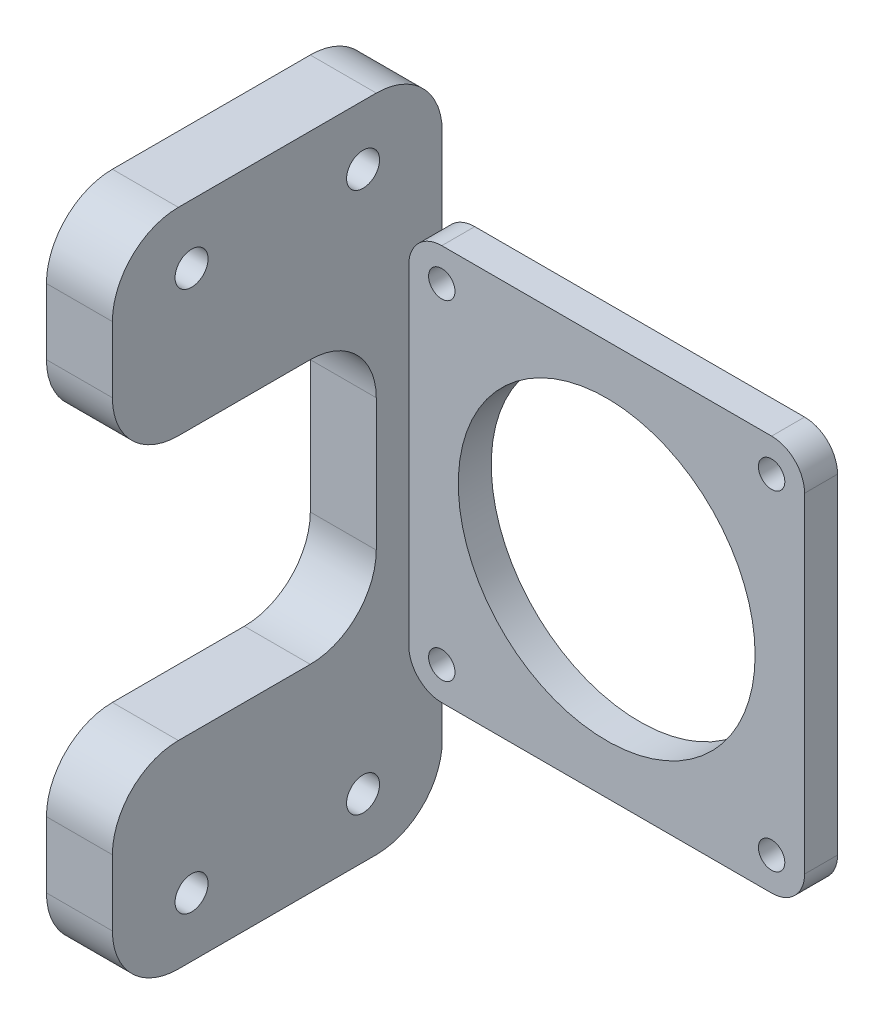
ISO-10303-21;
HEADER;
FILE_DESCRIPTION(('STEP AP214'),'2;1');
FILE_NAME('part.step','',(''),(''),'','','');
FILE_SCHEMA(('AUTOMOTIVE_DESIGN { 1 0 10303 214 1 1 1 1 }'));
ENDSEC;
DATA;
#1=APPLICATION_CONTEXT('core data for automotive mechanical design processes');
#2=APPLICATION_PROTOCOL_DEFINITION('international standard','automotive_design',2000,#1);
#3=PRODUCT_CONTEXT('',#1,'mechanical');
#4=PRODUCT('Part','Part','',(#3));
#5=PRODUCT_RELATED_PRODUCT_CATEGORY('part','',(#4));
#6=PRODUCT_DEFINITION_FORMATION('','',#4);
#7=PRODUCT_DEFINITION_CONTEXT('part definition',#1,'design');
#8=PRODUCT_DEFINITION('design','',#6,#7);
#9=PRODUCT_DEFINITION_SHAPE('','',#8);
#10=(LENGTH_UNIT() NAMED_UNIT(*) SI_UNIT(.MILLI.,.METRE.));
#11=(NAMED_UNIT(*) PLANE_ANGLE_UNIT() SI_UNIT($,.RADIAN.));
#12=(NAMED_UNIT(*) SI_UNIT($,.STERADIAN.) SOLID_ANGLE_UNIT());
#13=UNCERTAINTY_MEASURE_WITH_UNIT(LENGTH_MEASURE(1.E-05),#10,'distance_accuracy_value','');
#14=(GEOMETRIC_REPRESENTATION_CONTEXT(3) GLOBAL_UNCERTAINTY_ASSIGNED_CONTEXT((#13)) GLOBAL_UNIT_ASSIGNED_CONTEXT((#10,
#11,#12)) REPRESENTATION_CONTEXT('',''));
#15=CARTESIAN_POINT('',(0.,0.,0.));
#16=DIRECTION('',(0.,0.,1.));
#17=DIRECTION('',(1.,0.,0.));
#18=AXIS2_PLACEMENT_3D('',#15,#16,#17);
#19=CARTESIAN_POINT('',(-25.,-25.,5.));
#20=DIRECTION('',(0.,0.,-1.));
#21=DIRECTION('',(-1.,0.,0.));
#22=AXIS2_PLACEMENT_3D('',#19,#20,#21);
#23=PLANE('',#22);
#24=CARTESIAN_POINT('',(-25.,-25.,5.));
#25=DIRECTION('',(0.,0.,1.));
#26=DIRECTION('',(-1.,0.,0.));
#27=AXIS2_PLACEMENT_3D('',#24,#25,#26);
#28=CIRCLE('',#27,5.);
#29=CARTESIAN_POINT('',(-30.,-25.,5.));
#30=VERTEX_POINT('',#29);
#31=CARTESIAN_POINT('',(-25.,-30.,5.));
#32=VERTEX_POINT('',#31);
#33=EDGE_CURVE('E148',#30,#32,#28,.T.);
#34=ORIENTED_EDGE('',*,*,#33,.T.);
#35=DIRECTION('',(1.,0.,0.));
#36=VECTOR('',#35,1.);
#37=CARTESIAN_POINT('',(25.,-30.,5.));
#38=LINE('',#37,#36);
#39=CARTESIAN_POINT('',(25.,-30.,5.));
#40=VERTEX_POINT('',#39);
#41=EDGE_CURVE('E93',#32,#40,#38,.T.);
#42=ORIENTED_EDGE('',*,*,#41,.T.);
#43=CARTESIAN_POINT('',(25.,-25.,5.));
#44=DIRECTION('',(0.,0.,1.));
#45=DIRECTION('',(-1.,0.,0.));
#46=AXIS2_PLACEMENT_3D('',#43,#44,#45);
#47=CIRCLE('',#46,5.);
#48=CARTESIAN_POINT('',(30.,-24.9999999999999,5.));
#49=VERTEX_POINT('',#48);
#50=EDGE_CURVE('E163',#40,#49,#47,.T.);
#51=ORIENTED_EDGE('',*,*,#50,.T.);
#52=DIRECTION('',(0.,1.,0.));
#53=VECTOR('',#52,1.);
#54=CARTESIAN_POINT('',(30.,25.,5.));
#55=LINE('',#54,#53);
#56=CARTESIAN_POINT('',(30.,25.,5.));
#57=VERTEX_POINT('',#56);
#58=EDGE_CURVE('E175',#49,#57,#55,.T.);
#59=ORIENTED_EDGE('',*,*,#58,.T.);
#60=CARTESIAN_POINT('',(25.,25.,5.));
#61=DIRECTION('',(0.,0.,1.));
#62=DIRECTION('',(1.,0.,0.));
#63=AXIS2_PLACEMENT_3D('',#60,#61,#62);
#64=CIRCLE('',#63,5.);
#65=CARTESIAN_POINT('',(25.,30.,5.));
#66=VERTEX_POINT('',#65);
#67=EDGE_CURVE('E114',#57,#66,#64,.T.);
#68=ORIENTED_EDGE('',*,*,#67,.T.);
#69=DIRECTION('',(-1.,0.,0.));
#70=VECTOR('',#69,1.);
#71=CARTESIAN_POINT('',(25.,30.,5.));
#72=LINE('',#71,#70);
#73=CARTESIAN_POINT('',(-25.,30.,5.));
#74=VERTEX_POINT('',#73);
#75=EDGE_CURVE('E108',#66,#74,#72,.T.);
#76=ORIENTED_EDGE('',*,*,#75,.T.);
#77=CARTESIAN_POINT('',(-25.,25.,5.));
#78=DIRECTION('',(0.,0.,1.));
#79=DIRECTION('',(1.,0.,0.));
#80=AXIS2_PLACEMENT_3D('',#77,#78,#79);
#81=CIRCLE('',#80,5.);
#82=CARTESIAN_POINT('',(-30.,25.,5.));
#83=VERTEX_POINT('',#82);
#84=EDGE_CURVE('E111',#74,#83,#81,.T.);
#85=ORIENTED_EDGE('',*,*,#84,.T.);
#86=DIRECTION('',(0.,-1.,0.));
#87=VECTOR('',#86,1.);
#88=CARTESIAN_POINT('',(-30.,25.,5.));
#89=LINE('',#88,#87);
#90=EDGE_CURVE('E51',#83,#30,#89,.T.);
#91=ORIENTED_EDGE('',*,*,#90,.T.);
#92=EDGE_LOOP('',(#34,#42,#51,#59,#68,#76,#85,#91));
#93=FACE_BOUND('',#92,.T.);
#94=CARTESIAN_POINT('',(-25.,25.,5.));
#95=DIRECTION('',(0.,0.,1.));
#96=DIRECTION('',(1.,0.,0.));
#97=AXIS2_PLACEMENT_3D('',#94,#95,#96);
#98=CIRCLE('',#97,2.);
#99=CARTESIAN_POINT('',(-23.,25.,5.));
#100=VERTEX_POINT('',#99);
#101=EDGE_CURVE('E134',#100,#100,#98,.T.);
#102=ORIENTED_EDGE('',*,*,#101,.F.);
#103=EDGE_LOOP('',(#102));
#104=FACE_BOUND('',#103,.T.);
#105=CARTESIAN_POINT('',(25.,25.,5.));
#106=DIRECTION('',(0.,0.,1.));
#107=DIRECTION('',(-1.,0.,0.));
#108=AXIS2_PLACEMENT_3D('',#105,#106,#107);
#109=CIRCLE('',#108,2.);
#110=CARTESIAN_POINT('',(23.,25.,5.));
#111=VERTEX_POINT('',#110);
#112=EDGE_CURVE('E184',#111,#111,#109,.T.);
#113=ORIENTED_EDGE('',*,*,#112,.F.);
#114=EDGE_LOOP('',(#113));
#115=FACE_BOUND('',#114,.T.);
#116=CARTESIAN_POINT('',(25.,-25.,5.));
#117=DIRECTION('',(0.,0.,1.));
#118=DIRECTION('',(1.,0.,0.));
#119=AXIS2_PLACEMENT_3D('',#116,#117,#118);
#120=CIRCLE('',#119,2.);
#121=CARTESIAN_POINT('',(27.,-25.,5.));
#122=VERTEX_POINT('',#121);
#123=EDGE_CURVE('E190',#122,#122,#120,.T.);
#124=ORIENTED_EDGE('',*,*,#123,.F.);
#125=EDGE_LOOP('',(#124));
#126=FACE_BOUND('',#125,.T.);
#127=CARTESIAN_POINT('',(-25.,-25.,5.));
#128=DIRECTION('',(0.,0.,1.));
#129=DIRECTION('',(-1.,0.,0.));
#130=AXIS2_PLACEMENT_3D('',#127,#128,#129);
#131=CIRCLE('',#130,2.);
#132=CARTESIAN_POINT('',(-27.,-25.,5.));
#133=VERTEX_POINT('',#132);
#134=EDGE_CURVE('E196',#133,#133,#131,.T.);
#135=ORIENTED_EDGE('',*,*,#134,.F.);
#136=EDGE_LOOP('',(#135));
#137=FACE_BOUND('',#136,.T.);
#138=CARTESIAN_POINT('',(0.,0.,5.));
#139=DIRECTION('',(0.,0.,1.));
#140=DIRECTION('',(1.,0.,0.));
#141=AXIS2_PLACEMENT_3D('',#138,#139,#140);
#142=CIRCLE('',#141,22.5);
#143=CARTESIAN_POINT('',(22.5,0.,5.));
#144=VERTEX_POINT('',#143);
#145=EDGE_CURVE('E202',#144,#144,#142,.T.);
#146=ORIENTED_EDGE('',*,*,#145,.F.);
#147=EDGE_LOOP('',(#146));
#148=FACE_BOUND('',#147,.T.);
#149=ADVANCED_FACE('F34',(#93,#104,#115,#126,#137,#148),#23,.F.);
#150=CARTESIAN_POINT('',(-25.,-25.,0.));
#151=DIRECTION('',(0.,0.,-1.));
#152=DIRECTION('',(-1.,0.,0.));
#153=AXIS2_PLACEMENT_3D('',#150,#151,#152);
#154=PLANE('',#153);
#155=CARTESIAN_POINT('',(-25.,-25.,0.));
#156=DIRECTION('',(0.,0.,1.));
#157=DIRECTION('',(-1.,0.,0.));
#158=AXIS2_PLACEMENT_3D('',#155,#156,#157);
#159=CIRCLE('',#158,2.);
#160=CARTESIAN_POINT('',(-27.,-25.,0.));
#161=VERTEX_POINT('',#160);
#162=EDGE_CURVE('E199',#161,#161,#159,.T.);
#163=ORIENTED_EDGE('',*,*,#162,.T.);
#164=EDGE_LOOP('',(#163));
#165=FACE_BOUND('',#164,.T.);
#166=CARTESIAN_POINT('',(25.,25.,0.));
#167=DIRECTION('',(0.,0.,1.));
#168=DIRECTION('',(-1.,0.,0.));
#169=AXIS2_PLACEMENT_3D('',#166,#167,#168);
#170=CIRCLE('',#169,2.);
#171=CARTESIAN_POINT('',(23.,25.,0.));
#172=VERTEX_POINT('',#171);
#173=EDGE_CURVE('E187',#172,#172,#170,.T.);
#174=ORIENTED_EDGE('',*,*,#173,.T.);
#175=EDGE_LOOP('',(#174));
#176=FACE_BOUND('',#175,.T.);
#177=CARTESIAN_POINT('',(-25.,-25.,0.));
#178=DIRECTION('',(0.,0.,1.));
#179=DIRECTION('',(-1.,0.,0.));
#180=AXIS2_PLACEMENT_3D('',#177,#178,#179);
#181=CIRCLE('',#180,5.);
#182=CARTESIAN_POINT('',(-30.,-25.,0.));
#183=VERTEX_POINT('',#182);
#184=CARTESIAN_POINT('',(-25.,-30.,0.));
#185=VERTEX_POINT('',#184);
#186=EDGE_CURVE('E131',#183,#185,#181,.T.);
#187=ORIENTED_EDGE('',*,*,#186,.F.);
#188=DIRECTION('',(0.,-1.,0.));
#189=VECTOR('',#188,1.);
#190=CARTESIAN_POINT('',(-30.,25.,0.));
#191=LINE('',#190,#189);
#192=CARTESIAN_POINT('',(-30.,25.,0.));
#193=VERTEX_POINT('',#192);
#194=EDGE_CURVE('E145',#193,#183,#191,.T.);
#195=ORIENTED_EDGE('',*,*,#194,.F.);
#196=CARTESIAN_POINT('',(-25.,25.,0.));
#197=DIRECTION('',(0.,0.,1.));
#198=DIRECTION('',(1.,0.,0.));
#199=AXIS2_PLACEMENT_3D('',#196,#197,#198);
#200=CIRCLE('',#199,5.);
#201=CARTESIAN_POINT('',(-25.,30.,0.));
#202=VERTEX_POINT('',#201);
#203=EDGE_CURVE('E143',#202,#193,#200,.T.);
#204=ORIENTED_EDGE('',*,*,#203,.F.);
#205=DIRECTION('',(-1.,0.,0.));
#206=VECTOR('',#205,1.);
#207=CARTESIAN_POINT('',(25.,30.,0.));
#208=LINE('',#207,#206);
#209=CARTESIAN_POINT('',(25.,30.,0.));
#210=VERTEX_POINT('',#209);
#211=EDGE_CURVE('E78',#210,#202,#208,.T.);
#212=ORIENTED_EDGE('',*,*,#211,.F.);
#213=CARTESIAN_POINT('',(25.,25.,0.));
#214=DIRECTION('',(0.,0.,1.));
#215=DIRECTION('',(1.,0.,0.));
#216=AXIS2_PLACEMENT_3D('',#213,#214,#215);
#217=CIRCLE('',#216,5.);
#218=CARTESIAN_POINT('',(30.,25.,0.));
#219=VERTEX_POINT('',#218);
#220=EDGE_CURVE('E140',#219,#210,#217,.T.);
#221=ORIENTED_EDGE('',*,*,#220,.F.);
#222=DIRECTION('',(0.,1.,0.));
#223=VECTOR('',#222,1.);
#224=CARTESIAN_POINT('',(30.,25.,0.));
#225=LINE('',#224,#223);
#226=CARTESIAN_POINT('',(30.,-24.9999999999999,0.));
#227=VERTEX_POINT('',#226);
#228=EDGE_CURVE('E138',#227,#219,#225,.T.);
#229=ORIENTED_EDGE('',*,*,#228,.F.);
#230=CARTESIAN_POINT('',(25.,-25.,0.));
#231=DIRECTION('',(0.,0.,1.));
#232=DIRECTION('',(-1.,0.,0.));
#233=AXIS2_PLACEMENT_3D('',#230,#231,#232);
#234=CIRCLE('',#233,5.);
#235=CARTESIAN_POINT('',(25.,-30.,0.));
#236=VERTEX_POINT('',#235);
#237=EDGE_CURVE('E136',#236,#227,#234,.T.);
#238=ORIENTED_EDGE('',*,*,#237,.F.);
#239=DIRECTION('',(1.,0.,0.));
#240=VECTOR('',#239,1.);
#241=CARTESIAN_POINT('',(25.,-30.,0.));
#242=LINE('',#241,#240);
#243=EDGE_CURVE('E133',#185,#236,#242,.T.);
#244=ORIENTED_EDGE('',*,*,#243,.F.);
#245=EDGE_LOOP('',(#187,#195,#204,#212,#221,#229,#238,#244));
#246=FACE_BOUND('',#245,.T.);
#247=CARTESIAN_POINT('',(-25.,25.,0.));
#248=DIRECTION('',(0.,0.,1.));
#249=DIRECTION('',(1.,0.,0.));
#250=AXIS2_PLACEMENT_3D('',#247,#248,#249);
#251=CIRCLE('',#250,2.);
#252=CARTESIAN_POINT('',(-23.,25.,0.));
#253=VERTEX_POINT('',#252);
#254=EDGE_CURVE('E181',#253,#253,#251,.T.);
#255=ORIENTED_EDGE('',*,*,#254,.T.);
#256=EDGE_LOOP('',(#255));
#257=FACE_BOUND('',#256,.T.);
#258=CARTESIAN_POINT('',(25.,-25.,0.));
#259=DIRECTION('',(0.,0.,1.));
#260=DIRECTION('',(1.,0.,0.));
#261=AXIS2_PLACEMENT_3D('',#258,#259,#260);
#262=CIRCLE('',#261,2.);
#263=CARTESIAN_POINT('',(27.,-25.,0.));
#264=VERTEX_POINT('',#263);
#265=EDGE_CURVE('E193',#264,#264,#262,.T.);
#266=ORIENTED_EDGE('',*,*,#265,.T.);
#267=EDGE_LOOP('',(#266));
#268=FACE_BOUND('',#267,.T.);
#269=CARTESIAN_POINT('',(0.,0.,0.));
#270=DIRECTION('',(0.,0.,1.));
#271=DIRECTION('',(1.,0.,0.));
#272=AXIS2_PLACEMENT_3D('',#269,#270,#271);
#273=CIRCLE('',#272,22.5);
#274=CARTESIAN_POINT('',(22.5,0.,0.));
#275=VERTEX_POINT('',#274);
#276=EDGE_CURVE('E205',#275,#275,#273,.T.);
#277=ORIENTED_EDGE('',*,*,#276,.T.);
#278=EDGE_LOOP('',(#277));
#279=FACE_BOUND('',#278,.T.);
#280=ADVANCED_FACE('F166',(#165,#176,#246,#257,#268,#279),#154,.T.);
#281=CARTESIAN_POINT('',(-25.,-25.,5.));
#282=DIRECTION('',(0.,0.,-1.));
#283=DIRECTION('',(-1.,0.,0.));
#284=AXIS2_PLACEMENT_3D('',#281,#282,#283);
#285=CYLINDRICAL_SURFACE('',#284,5.);
#286=ORIENTED_EDGE('',*,*,#186,.T.);
#287=DIRECTION('',(0.,0.,-1.));
#288=VECTOR('',#287,1.);
#289=CARTESIAN_POINT('',(-25.,-30.,5.));
#290=LINE('',#289,#288);
#291=EDGE_CURVE('E11',#32,#185,#290,.T.);
#292=ORIENTED_EDGE('',*,*,#291,.F.);
#293=ORIENTED_EDGE('',*,*,#33,.F.);
#294=DIRECTION('',(0.,0.,-1.));
#295=VECTOR('',#294,1.);
#296=CARTESIAN_POINT('',(-30.,-25.,5.));
#297=LINE('',#296,#295);
#298=EDGE_CURVE('E85',#30,#183,#297,.T.);
#299=ORIENTED_EDGE('',*,*,#298,.T.);
#300=EDGE_LOOP('',(#286,#292,#293,#299));
#301=FACE_BOUND('',#300,.T.);
#302=ADVANCED_FACE('F36',(#301),#285,.T.);
#303=CARTESIAN_POINT('',(25.,-30.,5.));
#304=DIRECTION('',(0.,1.,0.));
#305=DIRECTION('',(-1.,0.,0.));
#306=AXIS2_PLACEMENT_3D('',#303,#304,#305);
#307=PLANE('',#306);
#308=ORIENTED_EDGE('',*,*,#243,.T.);
#309=DIRECTION('',(0.,0.,-1.));
#310=VECTOR('',#309,1.);
#311=CARTESIAN_POINT('',(25.,-30.,5.));
#312=LINE('',#311,#310);
#313=EDGE_CURVE('E43',#40,#236,#312,.T.);
#314=ORIENTED_EDGE('',*,*,#313,.F.);
#315=ORIENTED_EDGE('',*,*,#41,.F.);
#316=ORIENTED_EDGE('',*,*,#291,.T.);
#317=EDGE_LOOP('',(#308,#314,#315,#316));
#318=FACE_BOUND('',#317,.T.);
#319=ADVANCED_FACE('F558',(#318),#307,.F.);
#320=CARTESIAN_POINT('',(25.,-25.,5.));
#321=DIRECTION('',(0.,0.,-1.));
#322=DIRECTION('',(-1.,0.,0.));
#323=AXIS2_PLACEMENT_3D('',#320,#321,#322);
#324=CYLINDRICAL_SURFACE('',#323,5.);
#325=ORIENTED_EDGE('',*,*,#237,.T.);
#326=DIRECTION('',(0.,0.,-1.));
#327=VECTOR('',#326,1.);
#328=CARTESIAN_POINT('',(30.,-24.9999999999999,5.));
#329=LINE('',#328,#327);
#330=EDGE_CURVE('E155',#49,#227,#329,.T.);
#331=ORIENTED_EDGE('',*,*,#330,.F.);
#332=ORIENTED_EDGE('',*,*,#50,.F.);
#333=ORIENTED_EDGE('',*,*,#313,.T.);
#334=EDGE_LOOP('',(#325,#331,#332,#333));
#335=FACE_BOUND('',#334,.T.);
#336=ADVANCED_FACE('F161',(#335),#324,.T.);
#337=CARTESIAN_POINT('',(30.,25.,5.));
#338=DIRECTION('',(-1.,0.,0.));
#339=DIRECTION('',(0.,-1.,0.));
#340=AXIS2_PLACEMENT_3D('',#337,#338,#339);
#341=PLANE('',#340);
#342=ORIENTED_EDGE('',*,*,#228,.T.);
#343=DIRECTION('',(0.,0.,-1.));
#344=VECTOR('',#343,1.);
#345=CARTESIAN_POINT('',(30.,25.,5.));
#346=LINE('',#345,#344);
#347=EDGE_CURVE('E152',#57,#219,#346,.T.);
#348=ORIENTED_EDGE('',*,*,#347,.F.);
#349=ORIENTED_EDGE('',*,*,#58,.F.);
#350=ORIENTED_EDGE('',*,*,#330,.T.);
#351=EDGE_LOOP('',(#342,#348,#349,#350));
#352=FACE_BOUND('',#351,.T.);
#353=ADVANCED_FACE('F171',(#352),#341,.F.);
#354=CARTESIAN_POINT('',(25.,25.,5.));
#355=DIRECTION('',(0.,0.,-1.));
#356=DIRECTION('',(-1.,0.,0.));
#357=AXIS2_PLACEMENT_3D('',#354,#355,#356);
#358=CYLINDRICAL_SURFACE('',#357,5.);
#359=ORIENTED_EDGE('',*,*,#220,.T.);
#360=DIRECTION('',(0.,0.,-1.));
#361=VECTOR('',#360,1.);
#362=CARTESIAN_POINT('',(25.,30.,5.));
#363=LINE('',#362,#361);
#364=EDGE_CURVE('E122',#66,#210,#363,.T.);
#365=ORIENTED_EDGE('',*,*,#364,.F.);
#366=ORIENTED_EDGE('',*,*,#67,.F.);
#367=ORIENTED_EDGE('',*,*,#347,.T.);
#368=EDGE_LOOP('',(#359,#365,#366,#367));
#369=FACE_BOUND('',#368,.T.);
#370=ADVANCED_FACE('F174',(#369),#358,.T.);
#371=CARTESIAN_POINT('',(25.,30.,5.));
#372=DIRECTION('',(0.,-1.,0.));
#373=DIRECTION('',(1.,0.,0.));
#374=AXIS2_PLACEMENT_3D('',#371,#372,#373);
#375=PLANE('',#374);
#376=ORIENTED_EDGE('',*,*,#211,.T.);
#377=DIRECTION('',(0.,0.,-1.));
#378=VECTOR('',#377,1.);
#379=CARTESIAN_POINT('',(-25.,30.,5.));
#380=LINE('',#379,#378);
#381=EDGE_CURVE('E117',#74,#202,#380,.T.);
#382=ORIENTED_EDGE('',*,*,#381,.F.);
#383=ORIENTED_EDGE('',*,*,#75,.F.);
#384=ORIENTED_EDGE('',*,*,#364,.T.);
#385=EDGE_LOOP('',(#376,#382,#383,#384));
#386=FACE_BOUND('',#385,.T.);
#387=ADVANCED_FACE('F118',(#386),#375,.F.);
#388=CARTESIAN_POINT('',(-25.,25.,5.));
#389=DIRECTION('',(0.,0.,-1.));
#390=DIRECTION('',(-1.,0.,0.));
#391=AXIS2_PLACEMENT_3D('',#388,#389,#390);
#392=CYLINDRICAL_SURFACE('',#391,5.);
#393=ORIENTED_EDGE('',*,*,#203,.T.);
#394=DIRECTION('',(0.,0.,-1.));
#395=VECTOR('',#394,1.);
#396=CARTESIAN_POINT('',(-30.,25.,5.));
#397=LINE('',#396,#395);
#398=EDGE_CURVE('E123',#83,#193,#397,.T.);
#399=ORIENTED_EDGE('',*,*,#398,.F.);
#400=ORIENTED_EDGE('',*,*,#84,.F.);
#401=ORIENTED_EDGE('',*,*,#381,.T.);
#402=EDGE_LOOP('',(#393,#399,#400,#401));
#403=FACE_BOUND('',#402,.T.);
#404=ADVANCED_FACE('F125',(#403),#392,.T.);
#405=CARTESIAN_POINT('',(-25.,25.,5.));
#406=DIRECTION('',(0.,0.,-1.));
#407=DIRECTION('',(-1.,0.,0.));
#408=AXIS2_PLACEMENT_3D('',#405,#406,#407);
#409=CYLINDRICAL_SURFACE('',#408,2.);
#410=ORIENTED_EDGE('',*,*,#101,.T.);
#411=EDGE_LOOP('',(#410));
#412=FACE_BOUND('',#411,.T.);
#413=ORIENTED_EDGE('',*,*,#254,.F.);
#414=EDGE_LOOP('',(#413));
#415=FACE_BOUND('',#414,.T.);
#416=ADVANCED_FACE('F546',(#412,#415),#409,.F.);
#417=CARTESIAN_POINT('',(25.,25.,5.));
#418=DIRECTION('',(0.,0.,-1.));
#419=DIRECTION('',(-1.,0.,0.));
#420=AXIS2_PLACEMENT_3D('',#417,#418,#419);
#421=CYLINDRICAL_SURFACE('',#420,2.);
#422=ORIENTED_EDGE('',*,*,#112,.T.);
#423=EDGE_LOOP('',(#422));
#424=FACE_BOUND('',#423,.T.);
#425=ORIENTED_EDGE('',*,*,#173,.F.);
#426=EDGE_LOOP('',(#425));
#427=FACE_BOUND('',#426,.T.);
#428=ADVANCED_FACE('F754',(#424,#427),#421,.F.);
#429=CARTESIAN_POINT('',(25.,-25.,5.));
#430=DIRECTION('',(0.,0.,-1.));
#431=DIRECTION('',(-1.,0.,0.));
#432=AXIS2_PLACEMENT_3D('',#429,#430,#431);
#433=CYLINDRICAL_SURFACE('',#432,2.);
#434=ORIENTED_EDGE('',*,*,#123,.T.);
#435=EDGE_LOOP('',(#434));
#436=FACE_BOUND('',#435,.T.);
#437=ORIENTED_EDGE('',*,*,#265,.F.);
#438=EDGE_LOOP('',(#437));
#439=FACE_BOUND('',#438,.T.);
#440=ADVANCED_FACE('F745',(#436,#439),#433,.F.);
#441=CARTESIAN_POINT('',(-25.,-25.,5.));
#442=DIRECTION('',(0.,0.,-1.));
#443=DIRECTION('',(-1.,0.,0.));
#444=AXIS2_PLACEMENT_3D('',#441,#442,#443);
#445=CYLINDRICAL_SURFACE('',#444,2.);
#446=ORIENTED_EDGE('',*,*,#134,.T.);
#447=EDGE_LOOP('',(#446));
#448=FACE_BOUND('',#447,.T.);
#449=ORIENTED_EDGE('',*,*,#162,.F.);
#450=EDGE_LOOP('',(#449));
#451=FACE_BOUND('',#450,.T.);
#452=ADVANCED_FACE('F532',(#448,#451),#445,.F.);
#453=CARTESIAN_POINT('',(0.,0.,5.));
#454=DIRECTION('',(0.,0.,-1.));
#455=DIRECTION('',(-1.,0.,0.));
#456=AXIS2_PLACEMENT_3D('',#453,#454,#455);
#457=CYLINDRICAL_SURFACE('',#456,22.5);
#458=ORIENTED_EDGE('',*,*,#145,.T.);
#459=EDGE_LOOP('',(#458));
#460=FACE_BOUND('',#459,.T.);
#461=ORIENTED_EDGE('',*,*,#276,.F.);
#462=EDGE_LOOP('',(#461));
#463=FACE_BOUND('',#462,.T.);
#464=ADVANCED_FACE('F525',(#460,#463),#457,.F.);
#465=CARTESIAN_POINT('',(-40.,0.,49.9329322435087));
#466=DIRECTION('',(0.,0.,1.));
#467=DIRECTION('',(0.,-1.,0.));
#468=AXIS2_PLACEMENT_3D('',#465,#466,#467);
#469=PLANE('',#468);
#470=DIRECTION('',(0.,-1.,0.));
#471=VECTOR('',#470,1.);
#472=CARTESIAN_POINT('',(-30.,0.,49.9329322435087));
#473=LINE('',#472,#471);
#474=CARTESIAN_POINT('',(-30.,-30.,49.9329322435087));
#475=VERTEX_POINT('',#474);
#476=CARTESIAN_POINT('',(-30.,-39.9999999999999,49.9329322435087));
#477=VERTEX_POINT('',#476);
#478=EDGE_CURVE('E315',#475,#477,#473,.T.);
#479=ORIENTED_EDGE('',*,*,#478,.F.);
#480=DIRECTION('',(1.,0.,0.));
#481=VECTOR('',#480,1.);
#482=CARTESIAN_POINT('',(-40.,-30.,49.9329322435087));
#483=LINE('',#482,#481);
#484=CARTESIAN_POINT('',(-40.,-30.,49.9329322435087));
#485=VERTEX_POINT('',#484);
#486=EDGE_CURVE('E208',#485,#475,#483,.T.);
#487=ORIENTED_EDGE('',*,*,#486,.F.);
#488=DIRECTION('',(0.,-1.,0.));
#489=VECTOR('',#488,1.);
#490=CARTESIAN_POINT('',(-40.,0.,49.9329322435087));
#491=LINE('',#490,#489);
#492=CARTESIAN_POINT('',(-40.,-39.9999999999999,49.9329322435087));
#493=VERTEX_POINT('',#492);
#494=EDGE_CURVE('E262',#485,#493,#491,.T.);
#495=ORIENTED_EDGE('',*,*,#494,.T.);
#496=DIRECTION('',(1.,0.,0.));
#497=VECTOR('',#496,1.);
#498=CARTESIAN_POINT('',(-40.,-39.9999999999999,49.9329322435087));
#499=LINE('',#498,#497);
#500=EDGE_CURVE('E255',#493,#477,#499,.T.);
#501=ORIENTED_EDGE('',*,*,#500,.T.);
#502=EDGE_LOOP('',(#479,#487,#495,#501));
#503=FACE_BOUND('',#502,.T.);
#504=ADVANCED_FACE('F523',(#503),#469,.T.);
#505=CARTESIAN_POINT('',(-40.,-30.,39.9329322435086));
#506=DIRECTION('',(1.,0.,0.));
#507=DIRECTION('',(0.,1.,0.));
#508=AXIS2_PLACEMENT_3D('',#505,#506,#507);
#509=CYLINDRICAL_SURFACE('',#508,10.);
#510=CARTESIAN_POINT('',(-30.,-30.,39.9329322435086));
#511=DIRECTION('',(-1.,0.,0.));
#512=DIRECTION('',(0.,-1.,0.));
#513=AXIS2_PLACEMENT_3D('',#510,#511,#512);
#514=CIRCLE('',#513,10.);
#515=CARTESIAN_POINT('',(-30.,-20.,39.9329322435086));
#516=VERTEX_POINT('',#515);
#517=EDGE_CURVE('E312',#475,#516,#514,.T.);
#518=ORIENTED_EDGE('',*,*,#517,.T.);
#519=DIRECTION('',(1.,0.,0.));
#520=VECTOR('',#519,1.);
#521=CARTESIAN_POINT('',(-40.,-20.,39.9329322435086));
#522=LINE('',#521,#520);
#523=CARTESIAN_POINT('',(-40.,-20.,39.9329322435086));
#524=VERTEX_POINT('',#523);
#525=EDGE_CURVE('E213',#524,#516,#522,.T.);
#526=ORIENTED_EDGE('',*,*,#525,.F.);
#527=CARTESIAN_POINT('',(-40.,-30.,39.9329322435086));
#528=DIRECTION('',(-1.,0.,0.));
#529=DIRECTION('',(0.,-1.,0.));
#530=AXIS2_PLACEMENT_3D('',#527,#528,#529);
#531=CIRCLE('',#530,10.);
#532=EDGE_CURVE('E369',#485,#524,#531,.T.);
#533=ORIENTED_EDGE('',*,*,#532,.F.);
#534=ORIENTED_EDGE('',*,*,#486,.T.);
#535=EDGE_LOOP('',(#518,#526,#533,#534));
#536=FACE_BOUND('',#535,.T.);
#537=ADVANCED_FACE('F507',(#536),#509,.T.);
#538=CARTESIAN_POINT('',(-40.,-20.,0.));
#539=DIRECTION('',(0.,1.,0.));
#540=DIRECTION('',(-1.,0.,0.));
#541=AXIS2_PLACEMENT_3D('',#538,#539,#540);
#542=PLANE('',#541);
#543=DIRECTION('',(0.,0.,1.));
#544=VECTOR('',#543,1.);
#545=CARTESIAN_POINT('',(-30.,-20.,0.));
#546=LINE('',#545,#544);
#547=CARTESIAN_POINT('',(-30.,-20.,19.9329322435088));
#548=VERTEX_POINT('',#547);
#549=EDGE_CURVE('E309',#548,#516,#546,.T.);
#550=ORIENTED_EDGE('',*,*,#549,.F.);
#551=DIRECTION('',(1.,0.,0.));
#552=VECTOR('',#551,1.);
#553=CARTESIAN_POINT('',(-40.,-20.,19.9329322435088));
#554=LINE('',#553,#552);
#555=CARTESIAN_POINT('',(-40.,-20.,19.9329322435088));
#556=VERTEX_POINT('',#555);
#557=EDGE_CURVE('E216',#556,#548,#554,.T.);
#558=ORIENTED_EDGE('',*,*,#557,.F.);
#559=DIRECTION('',(0.,0.,1.));
#560=VECTOR('',#559,1.);
#561=CARTESIAN_POINT('',(-40.,-20.,0.));
#562=LINE('',#561,#560);
#563=EDGE_CURVE('E366',#556,#524,#562,.T.);
#564=ORIENTED_EDGE('',*,*,#563,.T.);
#565=ORIENTED_EDGE('',*,*,#525,.T.);
#566=EDGE_LOOP('',(#550,#558,#564,#565));
#567=FACE_BOUND('',#566,.T.);
#568=ADVANCED_FACE('F511',(#567),#542,.T.);
#569=CARTESIAN_POINT('',(-40.,-10.,19.9329322435087));
#570=DIRECTION('',(1.,0.,0.));
#571=DIRECTION('',(0.,1.,0.));
#572=AXIS2_PLACEMENT_3D('',#569,#570,#571);
#573=CYLINDRICAL_SURFACE('',#572,10.);
#574=CARTESIAN_POINT('',(-30.,-10.,19.9329322435087));
#575=DIRECTION('',(-1.,0.,0.));
#576=DIRECTION('',(0.,-1.,0.));
#577=AXIS2_PLACEMENT_3D('',#574,#575,#576);
#578=CIRCLE('',#577,10.);
#579=CARTESIAN_POINT('',(-30.,-9.99999999999994,9.93293224350871));
#580=VERTEX_POINT('',#579);
#581=EDGE_CURVE('E306',#548,#580,#578,.F.);
#582=ORIENTED_EDGE('',*,*,#581,.T.);
#583=DIRECTION('',(1.,0.,0.));
#584=VECTOR('',#583,1.);
#585=CARTESIAN_POINT('',(-40.,-9.99999999999994,9.93293224350871));
#586=LINE('',#585,#584);
#587=CARTESIAN_POINT('',(-40.,-9.99999999999994,9.93293224350871));
#588=VERTEX_POINT('',#587);
#589=EDGE_CURVE('E219',#588,#580,#586,.T.);
#590=ORIENTED_EDGE('',*,*,#589,.F.);
#591=CARTESIAN_POINT('',(-40.,-10.,19.9329322435087));
#592=DIRECTION('',(-1.,0.,0.));
#593=DIRECTION('',(0.,-1.,0.));
#594=AXIS2_PLACEMENT_3D('',#591,#592,#593);
#595=CIRCLE('',#594,10.);
#596=EDGE_CURVE('E363',#556,#588,#595,.F.);
#597=ORIENTED_EDGE('',*,*,#596,.F.);
#598=ORIENTED_EDGE('',*,*,#557,.T.);
#599=EDGE_LOOP('',(#582,#590,#597,#598));
#600=FACE_BOUND('',#599,.T.);
#601=ADVANCED_FACE('F516',(#600),#573,.F.);
#602=CARTESIAN_POINT('',(-40.,0.,9.93293224350871));
#603=DIRECTION('',(0.,0.,1.));
#604=DIRECTION('',(1.,0.,0.));
#605=AXIS2_PLACEMENT_3D('',#602,#603,#604);
#606=PLANE('',#605);
#607=DIRECTION('',(0.,-1.,0.));
#608=VECTOR('',#607,1.);
#609=CARTESIAN_POINT('',(-30.,0.,9.93293224350871));
#610=LINE('',#609,#608);
#611=CARTESIAN_POINT('',(-30.,9.99999999999992,9.93293224350871));
#612=VERTEX_POINT('',#611);
#613=EDGE_CURVE('E303',#612,#580,#610,.T.);
#614=ORIENTED_EDGE('',*,*,#613,.F.);
#615=DIRECTION('',(1.,0.,0.));
#616=VECTOR('',#615,1.);
#617=CARTESIAN_POINT('',(-40.,9.99999999999992,9.93293224350871));
#618=LINE('',#617,#616);
#619=CARTESIAN_POINT('',(-40.,9.99999999999992,9.93293224350871));
#620=VERTEX_POINT('',#619);
#621=EDGE_CURVE('E222',#620,#612,#618,.T.);
#622=ORIENTED_EDGE('',*,*,#621,.F.);
#623=DIRECTION('',(0.,-1.,0.));
#624=VECTOR('',#623,1.);
#625=CARTESIAN_POINT('',(-40.,0.,9.93293224350871));
#626=LINE('',#625,#624);
#627=EDGE_CURVE('E360',#620,#588,#626,.T.);
#628=ORIENTED_EDGE('',*,*,#627,.T.);
#629=ORIENTED_EDGE('',*,*,#589,.T.);
#630=EDGE_LOOP('',(#614,#622,#628,#629));
#631=FACE_BOUND('',#630,.T.);
#632=ADVANCED_FACE('F519',(#631),#606,.T.);
#633=CARTESIAN_POINT('',(-40.,9.99999999999999,19.9329322435087));
#634=DIRECTION('',(1.,0.,0.));
#635=DIRECTION('',(0.,1.,0.));
#636=AXIS2_PLACEMENT_3D('',#633,#634,#635);
#637=CYLINDRICAL_SURFACE('',#636,10.);
#638=CARTESIAN_POINT('',(-30.,10.,19.9329322435087));
#639=DIRECTION('',(-1.,0.,0.));
#640=DIRECTION('',(0.,-1.,0.));
#641=AXIS2_PLACEMENT_3D('',#638,#639,#640);
#642=CIRCLE('',#641,10.);
#643=CARTESIAN_POINT('',(-30.,20.,19.9329322435088));
#644=VERTEX_POINT('',#643);
#645=EDGE_CURVE('E300',#612,#644,#642,.F.);
#646=ORIENTED_EDGE('',*,*,#645,.T.);
#647=DIRECTION('',(1.,0.,0.));
#648=VECTOR('',#647,1.);
#649=CARTESIAN_POINT('',(-40.,20.,19.9329322435088));
#650=LINE('',#649,#648);
#651=CARTESIAN_POINT('',(-40.,20.,19.9329322435088));
#652=VERTEX_POINT('',#651);
#653=EDGE_CURVE('E225',#652,#644,#650,.T.);
#654=ORIENTED_EDGE('',*,*,#653,.F.);
#655=CARTESIAN_POINT('',(-40.,9.99999999999999,19.9329322435087));
#656=DIRECTION('',(-1.,0.,0.));
#657=DIRECTION('',(0.,-1.,0.));
#658=AXIS2_PLACEMENT_3D('',#655,#656,#657);
#659=CIRCLE('',#658,10.);
#660=EDGE_CURVE('E357',#620,#652,#659,.F.);
#661=ORIENTED_EDGE('',*,*,#660,.F.);
#662=ORIENTED_EDGE('',*,*,#621,.T.);
#663=EDGE_LOOP('',(#646,#654,#661,#662));
#664=FACE_BOUND('',#663,.T.);
#665=ADVANCED_FACE('F522',(#664),#637,.F.);
#666=CARTESIAN_POINT('',(-40.,20.,0.));
#667=DIRECTION('',(0.,1.,0.));
#668=DIRECTION('',(-1.,0.,0.));
#669=AXIS2_PLACEMENT_3D('',#666,#667,#668);
#670=PLANE('',#669);
#671=DIRECTION('',(0.,0.,1.));
#672=VECTOR('',#671,1.);
#673=CARTESIAN_POINT('',(-30.,20.,0.));
#674=LINE('',#673,#672);
#675=CARTESIAN_POINT('',(-30.,20.,39.9329322435086));
#676=VERTEX_POINT('',#675);
#677=EDGE_CURVE('E297',#644,#676,#674,.T.);
#678=ORIENTED_EDGE('',*,*,#677,.T.);
#679=DIRECTION('',(1.,0.,0.));
#680=VECTOR('',#679,1.);
#681=CARTESIAN_POINT('',(-40.,20.,39.9329322435086));
#682=LINE('',#681,#680);
#683=CARTESIAN_POINT('',(-40.,20.,39.9329322435086));
#684=VERTEX_POINT('',#683);
#685=EDGE_CURVE('E228',#684,#676,#682,.T.);
#686=ORIENTED_EDGE('',*,*,#685,.F.);
#687=DIRECTION('',(0.,0.,1.));
#688=VECTOR('',#687,1.);
#689=CARTESIAN_POINT('',(-40.,20.,0.));
#690=LINE('',#689,#688);
#691=EDGE_CURVE('E354',#652,#684,#690,.T.);
#692=ORIENTED_EDGE('',*,*,#691,.F.);
#693=ORIENTED_EDGE('',*,*,#653,.T.);
#694=EDGE_LOOP('',(#678,#686,#692,#693));
#695=FACE_BOUND('',#694,.T.);
#696=ADVANCED_FACE('F468',(#695),#670,.F.);
#697=CARTESIAN_POINT('',(-40.,30.,39.9329322435086));
#698=DIRECTION('',(1.,0.,0.));
#699=DIRECTION('',(0.,1.,0.));
#700=AXIS2_PLACEMENT_3D('',#697,#698,#699);
#701=CYLINDRICAL_SURFACE('',#700,10.);
#702=CARTESIAN_POINT('',(-30.,30.,39.9329322435086));
#703=DIRECTION('',(-1.,0.,0.));
#704=DIRECTION('',(0.,-1.,0.));
#705=AXIS2_PLACEMENT_3D('',#702,#703,#704);
#706=CIRCLE('',#705,10.);
#707=CARTESIAN_POINT('',(-30.,30.,49.9329322435086));
#708=VERTEX_POINT('',#707);
#709=EDGE_CURVE('E294',#708,#676,#706,.F.);
#710=ORIENTED_EDGE('',*,*,#709,.F.);
#711=DIRECTION('',(1.,0.,0.));
#712=VECTOR('',#711,1.);
#713=CARTESIAN_POINT('',(-40.,30.,49.9329322435086));
#714=LINE('',#713,#712);
#715=CARTESIAN_POINT('',(-40.,30.,49.9329322435086));
#716=VERTEX_POINT('',#715);
#717=EDGE_CURVE('E231',#716,#708,#714,.T.);
#718=ORIENTED_EDGE('',*,*,#717,.F.);
#719=CARTESIAN_POINT('',(-40.,30.,39.9329322435086));
#720=DIRECTION('',(-1.,0.,0.));
#721=DIRECTION('',(0.,-1.,0.));
#722=AXIS2_PLACEMENT_3D('',#719,#720,#721);
#723=CIRCLE('',#722,10.);
#724=EDGE_CURVE('E351',#716,#684,#723,.F.);
#725=ORIENTED_EDGE('',*,*,#724,.T.);
#726=ORIENTED_EDGE('',*,*,#685,.T.);
#727=EDGE_LOOP('',(#710,#718,#725,#726));
#728=FACE_BOUND('',#727,.T.);
#729=ADVANCED_FACE('F471',(#728),#701,.T.);
#730=CARTESIAN_POINT('',(-30.,39.9999999999999,49.9329322435086));
#731=VERTEX_POINT('',#730);
#732=EDGE_CURVE('E293',#731,#708,#473,.T.);
#733=ORIENTED_EDGE('',*,*,#732,.F.);
#734=DIRECTION('',(1.,0.,0.));
#735=VECTOR('',#734,1.);
#736=CARTESIAN_POINT('',(-40.,39.9999999999999,49.9329322435086));
#737=LINE('',#736,#735);
#738=CARTESIAN_POINT('',(-40.,39.9999999999999,49.9329322435086));
#739=VERTEX_POINT('',#738);
#740=EDGE_CURVE('E234',#739,#731,#737,.T.);
#741=ORIENTED_EDGE('',*,*,#740,.F.);
#742=EDGE_CURVE('E350',#739,#716,#491,.T.);
#743=ORIENTED_EDGE('',*,*,#742,.T.);
#744=ORIENTED_EDGE('',*,*,#717,.T.);
#745=EDGE_LOOP('',(#733,#741,#743,#744));
#746=FACE_BOUND('',#745,.T.);
#747=ADVANCED_FACE('F383',(#746),#469,.T.);
#748=CARTESIAN_POINT('',(-40.,40.,39.9329322435086));
#749=DIRECTION('',(1.,0.,0.));
#750=DIRECTION('',(0.,1.,0.));
#751=AXIS2_PLACEMENT_3D('',#748,#749,#750);
#752=CYLINDRICAL_SURFACE('',#751,10.);
#753=CARTESIAN_POINT('',(-30.,40.,39.9329322435086));
#754=DIRECTION('',(-1.,0.,0.));
#755=DIRECTION('',(0.,-1.,0.));
#756=AXIS2_PLACEMENT_3D('',#753,#754,#755);
#757=CIRCLE('',#756,10.);
#758=CARTESIAN_POINT('',(-30.,50.,39.9329322435086));
#759=VERTEX_POINT('',#758);
#760=EDGE_CURVE('E290',#731,#759,#757,.T.);
#761=ORIENTED_EDGE('',*,*,#760,.T.);
#762=DIRECTION('',(1.,0.,0.));
#763=VECTOR('',#762,1.);
#764=CARTESIAN_POINT('',(-40.,50.,39.9329322435086));
#765=LINE('',#764,#763);
#766=CARTESIAN_POINT('',(-40.,50.,39.9329322435086));
#767=VERTEX_POINT('',#766);
#768=EDGE_CURVE('E237',#767,#759,#765,.T.);
#769=ORIENTED_EDGE('',*,*,#768,.F.);
#770=CARTESIAN_POINT('',(-40.,40.,39.9329322435086));
#771=DIRECTION('',(-1.,0.,0.));
#772=DIRECTION('',(0.,-1.,0.));
#773=AXIS2_PLACEMENT_3D('',#770,#771,#772);
#774=CIRCLE('',#773,10.);
#775=EDGE_CURVE('E347',#739,#767,#774,.T.);
#776=ORIENTED_EDGE('',*,*,#775,.F.);
#777=ORIENTED_EDGE('',*,*,#740,.T.);
#778=EDGE_LOOP('',(#761,#769,#776,#777));
#779=FACE_BOUND('',#778,.T.);
#780=ADVANCED_FACE('F479',(#779),#752,.T.);
#781=CARTESIAN_POINT('',(-40.,50.,0.));
#782=DIRECTION('',(0.,1.,0.));
#783=DIRECTION('',(-1.,0.,0.));
#784=AXIS2_PLACEMENT_3D('',#781,#782,#783);
#785=PLANE('',#784);
#786=DIRECTION('',(0.,0.,1.));
#787=VECTOR('',#786,1.);
#788=CARTESIAN_POINT('',(-30.,50.,0.));
#789=LINE('',#788,#787);
#790=CARTESIAN_POINT('',(-30.,50.,9.93293224350871));
#791=VERTEX_POINT('',#790);
#792=EDGE_CURVE('E287',#791,#759,#789,.T.);
#793=ORIENTED_EDGE('',*,*,#792,.F.);
#794=DIRECTION('',(1.,0.,0.));
#795=VECTOR('',#794,1.);
#796=CARTESIAN_POINT('',(-40.,50.,9.93293224350871));
#797=LINE('',#796,#795);
#798=CARTESIAN_POINT('',(-40.,50.,9.93293224350871));
#799=VERTEX_POINT('',#798);
#800=EDGE_CURVE('E240',#799,#791,#797,.T.);
#801=ORIENTED_EDGE('',*,*,#800,.F.);
#802=DIRECTION('',(0.,0.,1.));
#803=VECTOR('',#802,1.);
#804=CARTESIAN_POINT('',(-40.,50.,0.));
#805=LINE('',#804,#803);
#806=EDGE_CURVE('E344',#799,#767,#805,.T.);
#807=ORIENTED_EDGE('',*,*,#806,.T.);
#808=ORIENTED_EDGE('',*,*,#768,.T.);
#809=EDGE_LOOP('',(#793,#801,#807,#808));
#810=FACE_BOUND('',#809,.T.);
#811=ADVANCED_FACE('F481',(#810),#785,.T.);
#812=CARTESIAN_POINT('',(-40.,40.,9.93293224350864));
#813=DIRECTION('',(1.,0.,0.));
#814=DIRECTION('',(0.,1.,0.));
#815=AXIS2_PLACEMENT_3D('',#812,#813,#814);
#816=CYLINDRICAL_SURFACE('',#815,10.);
#817=CARTESIAN_POINT('',(-30.,40.,9.93293224350864));
#818=DIRECTION('',(-1.,0.,0.));
#819=DIRECTION('',(0.,-1.,0.));
#820=AXIS2_PLACEMENT_3D('',#817,#818,#819);
#821=CIRCLE('',#820,10.);
#822=CARTESIAN_POINT('',(-30.,39.9999999999999,-0.067067756491356));
#823=VERTEX_POINT('',#822);
#824=EDGE_CURVE('E284',#823,#791,#821,.F.);
#825=ORIENTED_EDGE('',*,*,#824,.F.);
#826=DIRECTION('',(1.,0.,0.));
#827=VECTOR('',#826,1.);
#828=CARTESIAN_POINT('',(-40.,39.9999999999999,-0.067067756491356));
#829=LINE('',#828,#827);
#830=CARTESIAN_POINT('',(-40.,39.9999999999999,-0.067067756491356));
#831=VERTEX_POINT('',#830);
#832=EDGE_CURVE('E243',#831,#823,#829,.T.);
#833=ORIENTED_EDGE('',*,*,#832,.F.);
#834=CARTESIAN_POINT('',(-40.,40.,9.93293224350864));
#835=DIRECTION('',(-1.,0.,0.));
#836=DIRECTION('',(0.,-1.,0.));
#837=AXIS2_PLACEMENT_3D('',#834,#835,#836);
#838=CIRCLE('',#837,10.);
#839=EDGE_CURVE('E341',#831,#799,#838,.F.);
#840=ORIENTED_EDGE('',*,*,#839,.T.);
#841=ORIENTED_EDGE('',*,*,#800,.T.);
#842=EDGE_LOOP('',(#825,#833,#840,#841));
#843=FACE_BOUND('',#842,.T.);
#844=ADVANCED_FACE('F485',(#843),#816,.T.);
#845=CARTESIAN_POINT('',(-40.,0.,-0.0670677564913514));
#846=DIRECTION('',(0.,0.,1.));
#847=DIRECTION('',(0.,-1.,0.));
#848=AXIS2_PLACEMENT_3D('',#845,#846,#847);
#849=PLANE('',#848);
#850=DIRECTION('',(0.,-1.,0.));
#851=VECTOR('',#850,1.);
#852=CARTESIAN_POINT('',(-30.,0.,-0.0670677564913514));
#853=LINE('',#852,#851);
#854=CARTESIAN_POINT('',(-30.,-39.9999999999999,-0.0670677564913469));
#855=VERTEX_POINT('',#854);
#856=EDGE_CURVE('E281',#823,#855,#853,.T.);
#857=ORIENTED_EDGE('',*,*,#856,.T.);
#858=DIRECTION('',(1.,0.,0.));
#859=VECTOR('',#858,1.);
#860=CARTESIAN_POINT('',(-40.,-39.9999999999999,-0.0670677564913469));
#861=LINE('',#860,#859);
#862=CARTESIAN_POINT('',(-40.,-39.9999999999999,-0.0670677564913469));
#863=VERTEX_POINT('',#862);
#864=EDGE_CURVE('E246',#863,#855,#861,.T.);
#865=ORIENTED_EDGE('',*,*,#864,.F.);
#866=DIRECTION('',(0.,-1.,0.));
#867=VECTOR('',#866,1.);
#868=CARTESIAN_POINT('',(-40.,0.,-0.0670677564913514));
#869=LINE('',#868,#867);
#870=EDGE_CURVE('E338',#831,#863,#869,.T.);
#871=ORIENTED_EDGE('',*,*,#870,.F.);
#872=ORIENTED_EDGE('',*,*,#832,.T.);
#873=EDGE_LOOP('',(#857,#865,#871,#872));
#874=FACE_BOUND('',#873,.T.);
#875=ADVANCED_FACE('F490',(#874),#849,.F.);
#876=CARTESIAN_POINT('',(-40.,-40.,9.93293224350865));
#877=DIRECTION('',(1.,0.,0.));
#878=DIRECTION('',(0.,1.,0.));
#879=AXIS2_PLACEMENT_3D('',#876,#877,#878);
#880=CYLINDRICAL_SURFACE('',#879,10.);
#881=CARTESIAN_POINT('',(-30.,-40.,9.93293224350865));
#882=DIRECTION('',(-1.,0.,0.));
#883=DIRECTION('',(0.,-1.,0.));
#884=AXIS2_PLACEMENT_3D('',#881,#882,#883);
#885=CIRCLE('',#884,10.);
#886=CARTESIAN_POINT('',(-30.,-50.,9.93293224350872));
#887=VERTEX_POINT('',#886);
#888=EDGE_CURVE('E278',#887,#855,#885,.F.);
#889=ORIENTED_EDGE('',*,*,#888,.F.);
#890=DIRECTION('',(1.,0.,0.));
#891=VECTOR('',#890,1.);
#892=CARTESIAN_POINT('',(-40.,-50.,9.93293224350872));
#893=LINE('',#892,#891);
#894=CARTESIAN_POINT('',(-40.,-50.,9.93293224350872));
#895=VERTEX_POINT('',#894);
#896=EDGE_CURVE('E249',#895,#887,#893,.T.);
#897=ORIENTED_EDGE('',*,*,#896,.F.);
#898=CARTESIAN_POINT('',(-40.,-40.,9.93293224350865));
#899=DIRECTION('',(-1.,0.,0.));
#900=DIRECTION('',(0.,-1.,0.));
#901=AXIS2_PLACEMENT_3D('',#898,#899,#900);
#902=CIRCLE('',#901,10.);
#903=EDGE_CURVE('E335',#895,#863,#902,.F.);
#904=ORIENTED_EDGE('',*,*,#903,.T.);
#905=ORIENTED_EDGE('',*,*,#864,.T.);
#906=EDGE_LOOP('',(#889,#897,#904,#905));
#907=FACE_BOUND('',#906,.T.);
#908=ADVANCED_FACE('F496',(#907),#880,.T.);
#909=CARTESIAN_POINT('',(-40.,-50.,0.));
#910=DIRECTION('',(0.,1.,0.));
#911=DIRECTION('',(-1.,0.,0.));
#912=AXIS2_PLACEMENT_3D('',#909,#910,#911);
#913=PLANE('',#912);
#914=DIRECTION('',(0.,0.,1.));
#915=VECTOR('',#914,1.);
#916=CARTESIAN_POINT('',(-30.,-50.,0.));
#917=LINE('',#916,#915);
#918=CARTESIAN_POINT('',(-30.,-50.,39.9329322435086));
#919=VERTEX_POINT('',#918);
#920=EDGE_CURVE('E275',#887,#919,#917,.T.);
#921=ORIENTED_EDGE('',*,*,#920,.T.);
#922=DIRECTION('',(1.,0.,0.));
#923=VECTOR('',#922,1.);
#924=CARTESIAN_POINT('',(-40.,-50.,39.9329322435086));
#925=LINE('',#924,#923);
#926=CARTESIAN_POINT('',(-40.,-50.,39.9329322435086));
#927=VERTEX_POINT('',#926);
#928=EDGE_CURVE('E252',#927,#919,#925,.T.);
#929=ORIENTED_EDGE('',*,*,#928,.F.);
#930=DIRECTION('',(0.,0.,1.));
#931=VECTOR('',#930,1.);
#932=CARTESIAN_POINT('',(-40.,-50.,0.));
#933=LINE('',#932,#931);
#934=EDGE_CURVE('E332',#895,#927,#933,.T.);
#935=ORIENTED_EDGE('',*,*,#934,.F.);
#936=ORIENTED_EDGE('',*,*,#896,.T.);
#937=EDGE_LOOP('',(#921,#929,#935,#936));
#938=FACE_BOUND('',#937,.T.);
#939=ADVANCED_FACE('F499',(#938),#913,.F.);
#940=CARTESIAN_POINT('',(-40.,-41.,37.9329322435087));
#941=DIRECTION('',(1.,0.,0.));
#942=DIRECTION('',(0.,1.,0.));
#943=AXIS2_PLACEMENT_3D('',#940,#941,#942);
#944=CYLINDRICAL_SURFACE('',#943,2.5);
#945=CARTESIAN_POINT('',(-40.,-41.,37.9329322435087));
#946=DIRECTION('',(-1.,0.,0.));
#947=DIRECTION('',(0.,-1.,0.));
#948=AXIS2_PLACEMENT_3D('',#945,#946,#947);
#949=CIRCLE('',#948,2.5);
#950=CARTESIAN_POINT('',(-40.,-43.5,37.9329322435087));
#951=VERTEX_POINT('',#950);
#952=EDGE_CURVE('E320',#951,#951,#949,.T.);
#953=ORIENTED_EDGE('',*,*,#952,.T.);
#954=EDGE_LOOP('',(#953));
#955=FACE_BOUND('',#954,.T.);
#956=CARTESIAN_POINT('',(-30.,-41.,37.9329322435087));
#957=DIRECTION('',(-1.,0.,0.));
#958=DIRECTION('',(0.,-1.,0.));
#959=AXIS2_PLACEMENT_3D('',#956,#957,#958);
#960=CIRCLE('',#959,2.5);
#961=CARTESIAN_POINT('',(-30.,-43.5,37.9329322435087));
#962=VERTEX_POINT('',#961);
#963=EDGE_CURVE('E263',#962,#962,#960,.T.);
#964=ORIENTED_EDGE('',*,*,#963,.F.);
#965=EDGE_LOOP('',(#964));
#966=FACE_BOUND('',#965,.T.);
#967=ADVANCED_FACE('F577',(#955,#966),#944,.F.);
#968=CARTESIAN_POINT('',(-40.,41.,11.9329322435087));
#969=DIRECTION('',(1.,0.,0.));
#970=DIRECTION('',(0.,1.,0.));
#971=AXIS2_PLACEMENT_3D('',#968,#969,#970);
#972=CYLINDRICAL_SURFACE('',#971,2.5);
#973=CARTESIAN_POINT('',(-40.,41.,11.9329322435087));
#974=DIRECTION('',(-1.,0.,0.));
#975=DIRECTION('',(0.,-1.,0.));
#976=AXIS2_PLACEMENT_3D('',#973,#974,#975);
#977=CIRCLE('',#976,2.5);
#978=CARTESIAN_POINT('',(-40.,38.5,11.9329322435087));
#979=VERTEX_POINT('',#978);
#980=EDGE_CURVE('E323',#979,#979,#977,.T.);
#981=ORIENTED_EDGE('',*,*,#980,.T.);
#982=EDGE_LOOP('',(#981));
#983=FACE_BOUND('',#982,.T.);
#984=CARTESIAN_POINT('',(-30.,41.,11.9329322435087));
#985=DIRECTION('',(-1.,0.,0.));
#986=DIRECTION('',(0.,-1.,0.));
#987=AXIS2_PLACEMENT_3D('',#984,#985,#986);
#988=CIRCLE('',#987,2.5);
#989=CARTESIAN_POINT('',(-30.,38.5,11.9329322435087));
#990=VERTEX_POINT('',#989);
#991=EDGE_CURVE('E266',#990,#990,#988,.T.);
#992=ORIENTED_EDGE('',*,*,#991,.F.);
#993=EDGE_LOOP('',(#992));
#994=FACE_BOUND('',#993,.T.);
#995=ADVANCED_FACE('F580',(#983,#994),#972,.F.);
#996=CARTESIAN_POINT('',(-40.,41.,37.9329322435087));
#997=DIRECTION('',(1.,0.,0.));
#998=DIRECTION('',(0.,1.,0.));
#999=AXIS2_PLACEMENT_3D('',#996,#997,#998);
#1000=CYLINDRICAL_SURFACE('',#999,2.5);
#1001=CARTESIAN_POINT('',(-40.,41.,37.9329322435087));
#1002=DIRECTION('',(-1.,0.,0.));
#1003=DIRECTION('',(0.,-1.,0.));
#1004=AXIS2_PLACEMENT_3D('',#1001,#1002,#1003);
#1005=CIRCLE('',#1004,2.5);
#1006=CARTESIAN_POINT('',(-40.,38.5,37.9329322435087));
#1007=VERTEX_POINT('',#1006);
#1008=EDGE_CURVE('E326',#1007,#1007,#1005,.F.);
#1009=ORIENTED_EDGE('',*,*,#1008,.F.);
#1010=EDGE_LOOP('',(#1009));
#1011=FACE_BOUND('',#1010,.T.);
#1012=CARTESIAN_POINT('',(-30.,41.,37.9329322435087));
#1013=DIRECTION('',(-1.,0.,0.));
#1014=DIRECTION('',(0.,-1.,0.));
#1015=AXIS2_PLACEMENT_3D('',#1012,#1013,#1014);
#1016=CIRCLE('',#1015,2.5);
#1017=CARTESIAN_POINT('',(-30.,38.5,37.9329322435087));
#1018=VERTEX_POINT('',#1017);
#1019=EDGE_CURVE('E269',#1018,#1018,#1016,.F.);
#1020=ORIENTED_EDGE('',*,*,#1019,.T.);
#1021=EDGE_LOOP('',(#1020));
#1022=FACE_BOUND('',#1021,.T.);
#1023=ADVANCED_FACE('F584',(#1011,#1022),#1000,.F.);
#1024=CARTESIAN_POINT('',(-40.,-40.,39.9329322435087));
#1025=DIRECTION('',(1.,0.,0.));
#1026=DIRECTION('',(0.,1.,0.));
#1027=AXIS2_PLACEMENT_3D('',#1024,#1025,#1026);
#1028=CYLINDRICAL_SURFACE('',#1027,10.);
#1029=CARTESIAN_POINT('',(-30.,-40.,39.9329322435087));
#1030=DIRECTION('',(-1.,0.,0.));
#1031=DIRECTION('',(0.,-1.,0.));
#1032=AXIS2_PLACEMENT_3D('',#1029,#1030,#1031);
#1033=CIRCLE('',#1032,10.);
#1034=EDGE_CURVE('E272',#919,#477,#1033,.T.);
#1035=ORIENTED_EDGE('',*,*,#1034,.T.);
#1036=ORIENTED_EDGE('',*,*,#500,.F.);
#1037=CARTESIAN_POINT('',(-40.,-40.,39.9329322435087));
#1038=DIRECTION('',(-1.,0.,0.));
#1039=DIRECTION('',(0.,-1.,0.));
#1040=AXIS2_PLACEMENT_3D('',#1037,#1038,#1039);
#1041=CIRCLE('',#1040,10.);
#1042=EDGE_CURVE('E329',#927,#493,#1041,.T.);
#1043=ORIENTED_EDGE('',*,*,#1042,.F.);
#1044=ORIENTED_EDGE('',*,*,#928,.T.);
#1045=EDGE_LOOP('',(#1035,#1036,#1043,#1044));
#1046=FACE_BOUND('',#1045,.T.);
#1047=ADVANCED_FACE('F503',(#1046),#1028,.T.);
#1048=CARTESIAN_POINT('',(-40.,-41.,11.9329322435087));
#1049=DIRECTION('',(1.,0.,0.));
#1050=DIRECTION('',(0.,1.,0.));
#1051=AXIS2_PLACEMENT_3D('',#1048,#1049,#1050);
#1052=CYLINDRICAL_SURFACE('',#1051,2.5);
#1053=CARTESIAN_POINT('',(-40.,-41.,11.9329322435087));
#1054=DIRECTION('',(-1.,0.,0.));
#1055=DIRECTION('',(0.,-1.,0.));
#1056=AXIS2_PLACEMENT_3D('',#1053,#1054,#1055);
#1057=CIRCLE('',#1056,2.5);
#1058=CARTESIAN_POINT('',(-40.,-43.5,11.9329322435087));
#1059=VERTEX_POINT('',#1058);
#1060=EDGE_CURVE('E258',#1059,#1059,#1057,.F.);
#1061=ORIENTED_EDGE('',*,*,#1060,.F.);
#1062=EDGE_LOOP('',(#1061));
#1063=FACE_BOUND('',#1062,.T.);
#1064=CARTESIAN_POINT('',(-30.,-41.,11.9329322435087));
#1065=DIRECTION('',(-1.,0.,0.));
#1066=DIRECTION('',(0.,-1.,0.));
#1067=AXIS2_PLACEMENT_3D('',#1064,#1065,#1066);
#1068=CIRCLE('',#1067,2.5);
#1069=CARTESIAN_POINT('',(-30.,-43.5,11.9329322435087));
#1070=VERTEX_POINT('',#1069);
#1071=EDGE_CURVE('E259',#1070,#1070,#1068,.F.);
#1072=ORIENTED_EDGE('',*,*,#1071,.T.);
#1073=EDGE_LOOP('',(#1072));
#1074=FACE_BOUND('',#1073,.T.);
#1075=ADVANCED_FACE('F571',(#1063,#1074),#1052,.F.);
#1076=CARTESIAN_POINT('',(-40.,0.,0.));
#1077=DIRECTION('',(-1.,0.,0.));
#1078=DIRECTION('',(0.,-1.,0.));
#1079=AXIS2_PLACEMENT_3D('',#1076,#1077,#1078);
#1080=PLANE('',#1079);
#1081=ORIENTED_EDGE('',*,*,#494,.F.);
#1082=ORIENTED_EDGE('',*,*,#532,.T.);
#1083=ORIENTED_EDGE('',*,*,#563,.F.);
#1084=ORIENTED_EDGE('',*,*,#596,.T.);
#1085=ORIENTED_EDGE('',*,*,#627,.F.);
#1086=ORIENTED_EDGE('',*,*,#660,.T.);
#1087=ORIENTED_EDGE('',*,*,#691,.T.);
#1088=ORIENTED_EDGE('',*,*,#724,.F.);
#1089=ORIENTED_EDGE('',*,*,#742,.F.);
#1090=ORIENTED_EDGE('',*,*,#775,.T.);
#1091=ORIENTED_EDGE('',*,*,#806,.F.);
#1092=ORIENTED_EDGE('',*,*,#839,.F.);
#1093=ORIENTED_EDGE('',*,*,#870,.T.);
#1094=ORIENTED_EDGE('',*,*,#903,.F.);
#1095=ORIENTED_EDGE('',*,*,#934,.T.);
#1096=ORIENTED_EDGE('',*,*,#1042,.T.);
#1097=EDGE_LOOP('',(#1081,#1082,#1083,#1084,#1085,#1086,#1087,#1088,#1089,#1090,#1091,#1092,
#1093,#1094,#1095,#1096));
#1098=FACE_BOUND('',#1097,.T.);
#1099=ORIENTED_EDGE('',*,*,#1008,.T.);
#1100=EDGE_LOOP('',(#1099));
#1101=FACE_BOUND('',#1100,.T.);
#1102=ORIENTED_EDGE('',*,*,#980,.F.);
#1103=EDGE_LOOP('',(#1102));
#1104=FACE_BOUND('',#1103,.T.);
#1105=ORIENTED_EDGE('',*,*,#952,.F.);
#1106=EDGE_LOOP('',(#1105));
#1107=FACE_BOUND('',#1106,.T.);
#1108=ORIENTED_EDGE('',*,*,#1060,.T.);
#1109=EDGE_LOOP('',(#1108));
#1110=FACE_BOUND('',#1109,.T.);
#1111=ADVANCED_FACE('F393',(#1098,#1101,#1104,#1107,#1110),#1080,.T.);
#1112=CARTESIAN_POINT('',(-30.,0.,0.));
#1113=DIRECTION('',(-1.,0.,0.));
#1114=DIRECTION('',(0.,-1.,0.));
#1115=AXIS2_PLACEMENT_3D('',#1112,#1113,#1114);
#1116=PLANE('',#1115);
#1117=ORIENTED_EDGE('',*,*,#298,.F.);
#1118=ORIENTED_EDGE('',*,*,#90,.F.);
#1119=ORIENTED_EDGE('',*,*,#398,.T.);
#1120=ORIENTED_EDGE('',*,*,#194,.T.);
#1121=EDGE_LOOP('',(#1117,#1118,#1119,#1120));
#1122=FACE_BOUND('',#1121,.T.);
#1123=ORIENTED_EDGE('',*,*,#478,.T.);
#1124=ORIENTED_EDGE('',*,*,#1034,.F.);
#1125=ORIENTED_EDGE('',*,*,#920,.F.);
#1126=ORIENTED_EDGE('',*,*,#888,.T.);
#1127=ORIENTED_EDGE('',*,*,#856,.F.);
#1128=ORIENTED_EDGE('',*,*,#824,.T.);
#1129=ORIENTED_EDGE('',*,*,#792,.T.);
#1130=ORIENTED_EDGE('',*,*,#760,.F.);
#1131=ORIENTED_EDGE('',*,*,#732,.T.);
#1132=ORIENTED_EDGE('',*,*,#709,.T.);
#1133=ORIENTED_EDGE('',*,*,#677,.F.);
#1134=ORIENTED_EDGE('',*,*,#645,.F.);
#1135=ORIENTED_EDGE('',*,*,#613,.T.);
#1136=ORIENTED_EDGE('',*,*,#581,.F.);
#1137=ORIENTED_EDGE('',*,*,#549,.T.);
#1138=ORIENTED_EDGE('',*,*,#517,.F.);
#1139=EDGE_LOOP('',(#1123,#1124,#1125,#1126,#1127,#1128,#1129,#1130,#1131,#1132,#1133,#1134,
#1135,#1136,#1137,#1138));
#1140=FACE_BOUND('',#1139,.T.);
#1141=ORIENTED_EDGE('',*,*,#1019,.F.);
#1142=EDGE_LOOP('',(#1141));
#1143=FACE_BOUND('',#1142,.T.);
#1144=ORIENTED_EDGE('',*,*,#991,.T.);
#1145=EDGE_LOOP('',(#1144));
#1146=FACE_BOUND('',#1145,.T.);
#1147=ORIENTED_EDGE('',*,*,#963,.T.);
#1148=EDGE_LOOP('',(#1147));
#1149=FACE_BOUND('',#1148,.T.);
#1150=ORIENTED_EDGE('',*,*,#1071,.F.);
#1151=EDGE_LOOP('',(#1150));
#1152=FACE_BOUND('',#1151,.T.);
#1153=ADVANCED_FACE('F475',(#1122,#1140,#1143,#1146,#1149,#1152),#1116,.F.);
#1154=CLOSED_SHELL('',(#149,#280,#302,#319,#336,#353,#370,#387,#404,#416,#428,#440,#452,#464,
#504,#537,#568,#601,#632,#665,#696,#729,#747,#780,#811,#844,#875,#908,#939,#967,#995,#1023,
#1047,#1075,#1111,#1153));
#1155=MANIFOLD_SOLID_BREP('B2',#1154);
#1156=ADVANCED_BREP_SHAPE_REPRESENTATION('',(#18,#1155),#14);
#1157=SHAPE_DEFINITION_REPRESENTATION(#9,#1156);
ENDSEC;
END-ISO-10303-21;
